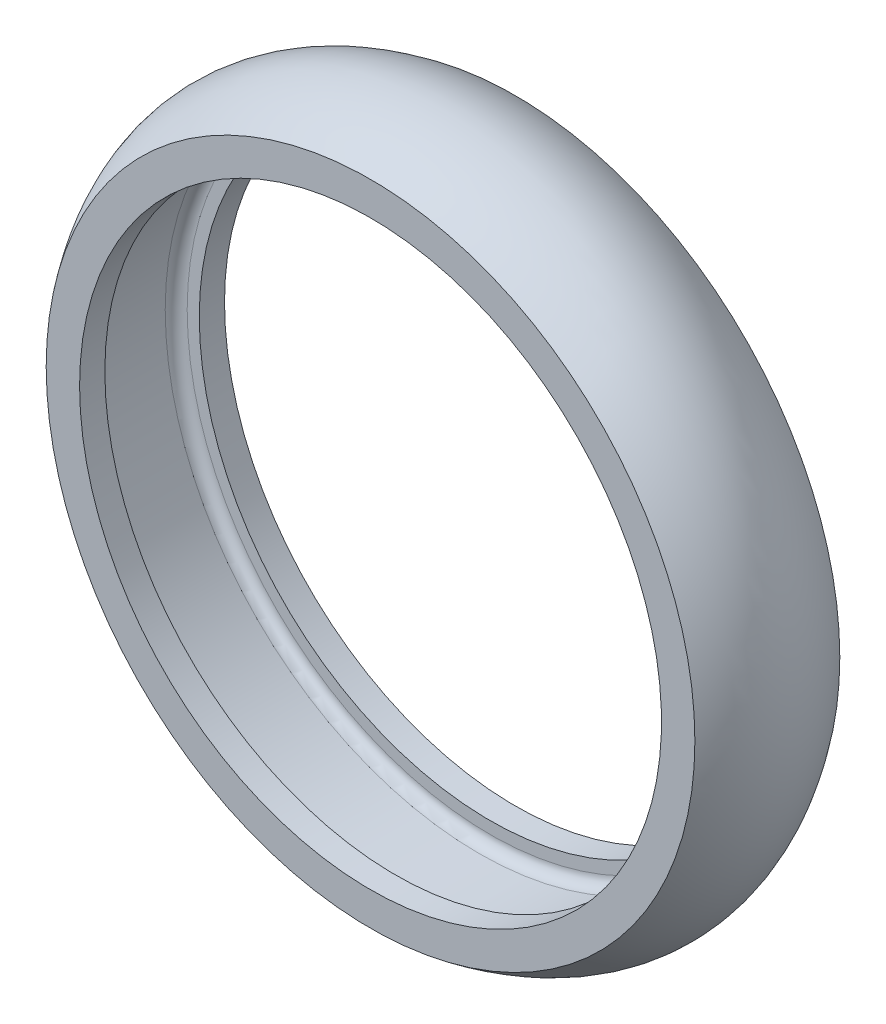
ISO-10303-21;
HEADER;
FILE_DESCRIPTION(('STEP AP214'),'2;1');
FILE_NAME('part.step','',(''),(''),'','','');
FILE_SCHEMA(('AUTOMOTIVE_DESIGN { 1 0 10303 214 1 1 1 1 }'));
ENDSEC;
DATA;
#1=APPLICATION_CONTEXT('core data for automotive mechanical design processes');
#2=APPLICATION_PROTOCOL_DEFINITION('international standard','automotive_design',2000,#1);
#3=PRODUCT_CONTEXT('',#1,'mechanical');
#4=PRODUCT('Part','Part','',(#3));
#5=PRODUCT_RELATED_PRODUCT_CATEGORY('part','',(#4));
#6=PRODUCT_DEFINITION_FORMATION('','',#4);
#7=PRODUCT_DEFINITION_CONTEXT('part definition',#1,'design');
#8=PRODUCT_DEFINITION('design','',#6,#7);
#9=PRODUCT_DEFINITION_SHAPE('','',#8);
#10=(LENGTH_UNIT() NAMED_UNIT(*) SI_UNIT(.MILLI.,.METRE.));
#11=(NAMED_UNIT(*) PLANE_ANGLE_UNIT() SI_UNIT($,.RADIAN.));
#12=(NAMED_UNIT(*) SI_UNIT($,.STERADIAN.) SOLID_ANGLE_UNIT());
#13=UNCERTAINTY_MEASURE_WITH_UNIT(LENGTH_MEASURE(1.E-05),#10,'distance_accuracy_value','');
#14=(GEOMETRIC_REPRESENTATION_CONTEXT(3) GLOBAL_UNCERTAINTY_ASSIGNED_CONTEXT((#13)) GLOBAL_UNIT_ASSIGNED_CONTEXT((#10,
#11,#12)) REPRESENTATION_CONTEXT('',''));
#15=CARTESIAN_POINT('',(0.,0.,0.));
#16=DIRECTION('',(0.,0.,1.));
#17=DIRECTION('',(1.,0.,0.));
#18=AXIS2_PLACEMENT_3D('',#15,#16,#17);
#19=CARTESIAN_POINT('',(0.,0.,-4.62141621486193));
#20=DIRECTION('',(0.,0.,-1.));
#21=DIRECTION('',(-1.,0.,0.));
#22=AXIS2_PLACEMENT_3D('',#19,#20,#21);
#23=CYLINDRICAL_SURFACE('',#22,13.25);
#24=CARTESIAN_POINT('',(0.,0.,3.3));
#25=DIRECTION('',(0.,0.,-1.));
#26=DIRECTION('',(-1.,0.,0.));
#27=AXIS2_PLACEMENT_3D('',#24,#25,#26);
#28=CIRCLE('',#27,13.25);
#29=CARTESIAN_POINT('',(-13.25,0.,3.3));
#30=VERTEX_POINT('',#29);
#31=EDGE_CURVE('E10',#30,#30,#28,.T.);
#32=ORIENTED_EDGE('',*,*,#31,.F.);
#33=EDGE_LOOP('',(#32));
#34=FACE_BOUND('',#33,.T.);
#35=CARTESIAN_POINT('',(0.,0.,2.15));
#36=DIRECTION('',(0.,0.,-1.));
#37=DIRECTION('',(-1.,0.,0.));
#38=AXIS2_PLACEMENT_3D('',#35,#36,#37);
#39=CIRCLE('',#38,13.25);
#40=CARTESIAN_POINT('',(-13.25,0.,2.15));
#41=VERTEX_POINT('',#40);
#42=EDGE_CURVE('E36',#41,#41,#39,.T.);
#43=ORIENTED_EDGE('',*,*,#42,.T.);
#44=EDGE_LOOP('',(#43));
#45=FACE_BOUND('',#44,.T.);
#46=ADVANCED_FACE('F30',(#34,#45),#23,.F.);
#47=CARTESIAN_POINT('',(13.25,0.,2.15));
#48=DIRECTION('',(0.,0.,1.));
#49=DIRECTION('',(1.,0.,0.));
#50=AXIS2_PLACEMENT_3D('',#47,#48,#49);
#51=PLANE('',#50);
#52=ORIENTED_EDGE('',*,*,#42,.F.);
#53=EDGE_LOOP('',(#52));
#54=FACE_BOUND('',#53,.T.);
#55=CARTESIAN_POINT('',(0.,0.,2.15));
#56=DIRECTION('',(0.,0.,-1.));
#57=DIRECTION('',(-1.,0.,0.));
#58=AXIS2_PLACEMENT_3D('',#55,#56,#57);
#59=CIRCLE('',#58,13.8);
#60=CARTESIAN_POINT('',(-13.8,0.,2.15));
#61=VERTEX_POINT('',#60);
#62=EDGE_CURVE('E40',#61,#61,#59,.T.);
#63=ORIENTED_EDGE('',*,*,#62,.T.);
#64=EDGE_LOOP('',(#63));
#65=FACE_BOUND('',#64,.T.);
#66=ADVANCED_FACE('F102',(#54,#65),#51,.F.);
#67=CARTESIAN_POINT('',(0.,0.,1.65));
#68=DIRECTION('',(0.,0.,-1.));
#69=DIRECTION('',(-1.,0.,0.));
#70=AXIS2_PLACEMENT_3D('',#67,#68,#69);
#71=TOROIDAL_SURFACE('',#70,13.8,0.5);
#72=ORIENTED_EDGE('',*,*,#62,.F.);
#73=EDGE_LOOP('',(#72));
#74=FACE_BOUND('',#73,.T.);
#75=CARTESIAN_POINT('',(0.,0.,1.65));
#76=DIRECTION('',(0.,0.,-1.));
#77=DIRECTION('',(-1.,0.,0.));
#78=AXIS2_PLACEMENT_3D('',#75,#76,#77);
#79=CIRCLE('',#78,14.3);
#80=CARTESIAN_POINT('',(-14.3,0.,1.65));
#81=VERTEX_POINT('',#80);
#82=EDGE_CURVE('E44',#81,#81,#79,.T.);
#83=ORIENTED_EDGE('',*,*,#82,.T.);
#84=EDGE_LOOP('',(#83));
#85=FACE_BOUND('',#84,.T.);
#86=ADVANCED_FACE('F99',(#74,#85),#71,.F.);
#87=CARTESIAN_POINT('',(0.,0.,-4.62141621486193));
#88=DIRECTION('',(0.,0.,-1.));
#89=DIRECTION('',(-1.,0.,0.));
#90=AXIS2_PLACEMENT_3D('',#87,#88,#89);
#91=CYLINDRICAL_SURFACE('',#90,14.3);
#92=ORIENTED_EDGE('',*,*,#82,.F.);
#93=EDGE_LOOP('',(#92));
#94=FACE_BOUND('',#93,.T.);
#95=CARTESIAN_POINT('',(0.,0.,-1.65));
#96=DIRECTION('',(0.,0.,-1.));
#97=DIRECTION('',(-1.,0.,0.));
#98=AXIS2_PLACEMENT_3D('',#95,#96,#97);
#99=CIRCLE('',#98,14.3);
#100=CARTESIAN_POINT('',(-14.3,0.,-1.65));
#101=VERTEX_POINT('',#100);
#102=EDGE_CURVE('E49',#101,#101,#99,.T.);
#103=ORIENTED_EDGE('',*,*,#102,.T.);
#104=EDGE_LOOP('',(#103));
#105=FACE_BOUND('',#104,.T.);
#106=ADVANCED_FACE('F95',(#94,#105),#91,.F.);
#107=CARTESIAN_POINT('',(0.,0.,-1.65));
#108=DIRECTION('',(0.,0.,-1.));
#109=DIRECTION('',(-1.,0.,0.));
#110=AXIS2_PLACEMENT_3D('',#107,#108,#109);
#111=TOROIDAL_SURFACE('',#110,13.8,0.5);
#112=ORIENTED_EDGE('',*,*,#102,.F.);
#113=EDGE_LOOP('',(#112));
#114=FACE_BOUND('',#113,.T.);
#115=CARTESIAN_POINT('',(0.,0.,-2.15));
#116=DIRECTION('',(0.,0.,-1.));
#117=DIRECTION('',(-1.,0.,0.));
#118=AXIS2_PLACEMENT_3D('',#115,#116,#117);
#119=CIRCLE('',#118,13.8);
#120=CARTESIAN_POINT('',(-13.8,0.,-2.15));
#121=VERTEX_POINT('',#120);
#122=EDGE_CURVE('E52',#121,#121,#119,.T.);
#123=ORIENTED_EDGE('',*,*,#122,.T.);
#124=EDGE_LOOP('',(#123));
#125=FACE_BOUND('',#124,.T.);
#126=ADVANCED_FACE('F91',(#114,#125),#111,.F.);
#127=CARTESIAN_POINT('',(13.25,0.,-2.15));
#128=DIRECTION('',(0.,0.,-1.));
#129=DIRECTION('',(-1.,0.,0.));
#130=AXIS2_PLACEMENT_3D('',#127,#128,#129);
#131=PLANE('',#130);
#132=ORIENTED_EDGE('',*,*,#122,.F.);
#133=EDGE_LOOP('',(#132));
#134=FACE_BOUND('',#133,.T.);
#135=CARTESIAN_POINT('',(0.,0.,-2.15));
#136=DIRECTION('',(0.,0.,-1.));
#137=DIRECTION('',(-1.,0.,0.));
#138=AXIS2_PLACEMENT_3D('',#135,#136,#137);
#139=CIRCLE('',#138,13.25);
#140=CARTESIAN_POINT('',(-13.25,0.,-2.15));
#141=VERTEX_POINT('',#140);
#142=EDGE_CURVE('E55',#141,#141,#139,.T.);
#143=ORIENTED_EDGE('',*,*,#142,.T.);
#144=EDGE_LOOP('',(#143));
#145=FACE_BOUND('',#144,.T.);
#146=ADVANCED_FACE('F87',(#134,#145),#131,.F.);
#147=CARTESIAN_POINT('',(0.,0.,-4.62141621486193));
#148=DIRECTION('',(0.,0.,-1.));
#149=DIRECTION('',(-1.,0.,0.));
#150=AXIS2_PLACEMENT_3D('',#147,#148,#149);
#151=CYLINDRICAL_SURFACE('',#150,13.25);
#152=ORIENTED_EDGE('',*,*,#142,.F.);
#153=EDGE_LOOP('',(#152));
#154=FACE_BOUND('',#153,.T.);
#155=CARTESIAN_POINT('',(0.,0.,-3.3));
#156=DIRECTION('',(0.,0.,-1.));
#157=DIRECTION('',(-1.,0.,0.));
#158=AXIS2_PLACEMENT_3D('',#155,#156,#157);
#159=CIRCLE('',#158,13.25);
#160=CARTESIAN_POINT('',(-13.25,0.,-3.3));
#161=VERTEX_POINT('',#160);
#162=EDGE_CURVE('E58',#161,#161,#159,.T.);
#163=ORIENTED_EDGE('',*,*,#162,.T.);
#164=EDGE_LOOP('',(#163));
#165=FACE_BOUND('',#164,.T.);
#166=ADVANCED_FACE('F83',(#154,#165),#151,.F.);
#167=CARTESIAN_POINT('',(14.3,0.,-3.3));
#168=DIRECTION('',(0.,0.,1.));
#169=DIRECTION('',(1.,0.,0.));
#170=AXIS2_PLACEMENT_3D('',#167,#168,#169);
#171=PLANE('',#170);
#172=ORIENTED_EDGE('',*,*,#162,.F.);
#173=EDGE_LOOP('',(#172));
#174=FACE_BOUND('',#173,.T.);
#175=CARTESIAN_POINT('',(0.,0.,-3.3));
#176=DIRECTION('',(0.,0.,-1.));
#177=DIRECTION('',(-1.,0.,0.));
#178=AXIS2_PLACEMENT_3D('',#175,#176,#177);
#179=CIRCLE('',#178,14.7708449646129);
#180=CARTESIAN_POINT('',(-14.7708449646129,0.,-3.3));
#181=VERTEX_POINT('',#180);
#182=EDGE_CURVE('E61',#181,#181,#179,.T.);
#183=ORIENTED_EDGE('',*,*,#182,.T.);
#184=EDGE_LOOP('',(#183));
#185=FACE_BOUND('',#184,.T.);
#186=ADVANCED_FACE('F79',(#174,#185),#171,.F.);
#187=CARTESIAN_POINT('',(14.7708449646129,0.,3.3));
#188=CARTESIAN_POINT('',(17.2291550353871,0.,0.));
#189=CARTESIAN_POINT('',(14.7708449646129,0.,-3.3));
#190=B_SPLINE_CURVE_WITH_KNOTS('',2,(#187,#188,#189),.UNSPECIFIED.,.F.,.F.,(3,3),(0.,1.),.UNSPECIFIED.);
#191=CARTESIAN_POINT('',(0.,0.,-4.62141621486193));
#192=DIRECTION('',(0.,0.,-1.));
#193=AXIS1_PLACEMENT('',#191,#192);
#194=SURFACE_OF_REVOLUTION('',#190,#193);
#195=ORIENTED_EDGE('',*,*,#182,.F.);
#196=EDGE_LOOP('',(#195));
#197=FACE_BOUND('',#196,.T.);
#198=CARTESIAN_POINT('',(0.,0.,3.3));
#199=DIRECTION('',(0.,0.,-1.));
#200=DIRECTION('',(-1.,0.,0.));
#201=AXIS2_PLACEMENT_3D('',#198,#199,#200);
#202=CIRCLE('',#201,14.7708449646129);
#203=CARTESIAN_POINT('',(-14.7708449646129,0.,3.3));
#204=VERTEX_POINT('',#203);
#205=EDGE_CURVE('E64',#204,#204,#202,.T.);
#206=ORIENTED_EDGE('',*,*,#205,.T.);
#207=EDGE_LOOP('',(#206));
#208=FACE_BOUND('',#207,.T.);
#209=ADVANCED_FACE('F74',(#197,#208),#194,.T.);
#210=CARTESIAN_POINT('',(14.7708449646129,0.,3.3));
#211=DIRECTION('',(0.,0.,-1.));
#212=DIRECTION('',(-1.,0.,0.));
#213=AXIS2_PLACEMENT_3D('',#210,#211,#212);
#214=PLANE('',#213);
#215=ORIENTED_EDGE('',*,*,#205,.F.);
#216=EDGE_LOOP('',(#215));
#217=FACE_BOUND('',#216,.T.);
#218=ORIENTED_EDGE('',*,*,#31,.T.);
#219=EDGE_LOOP('',(#218));
#220=FACE_BOUND('',#219,.T.);
#221=ADVANCED_FACE('F78',(#217,#220),#214,.F.);
#222=CLOSED_SHELL('',(#46,#66,#86,#106,#126,#146,#166,#186,#209,#221));
#223=MANIFOLD_SOLID_BREP('B2',#222);
#224=ADVANCED_BREP_SHAPE_REPRESENTATION('',(#18,#223),#14);
#225=SHAPE_DEFINITION_REPRESENTATION(#9,#224);
ENDSEC;
END-ISO-10303-21;
